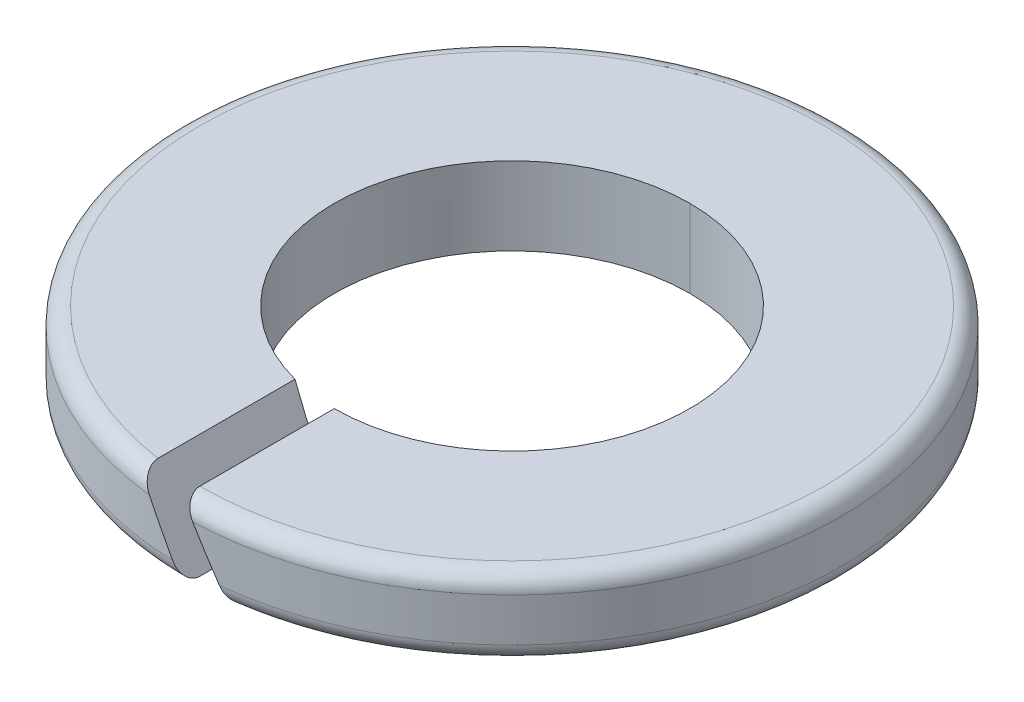
ISO-10303-21;
HEADER;
FILE_DESCRIPTION(('STEP AP214'),'2;1');
FILE_NAME('part.step','',(''),(''),'','','');
FILE_SCHEMA(('AUTOMOTIVE_DESIGN { 1 0 10303 214 1 1 1 1 }'));
ENDSEC;
DATA;
#1=APPLICATION_CONTEXT('core data for automotive mechanical design processes');
#2=APPLICATION_PROTOCOL_DEFINITION('international standard','automotive_design',2000,#1);
#3=PRODUCT_CONTEXT('',#1,'mechanical');
#4=PRODUCT('Part','Part','',(#3));
#5=PRODUCT_RELATED_PRODUCT_CATEGORY('part','',(#4));
#6=PRODUCT_DEFINITION_FORMATION('','',#4);
#7=PRODUCT_DEFINITION_CONTEXT('part definition',#1,'design');
#8=PRODUCT_DEFINITION('design','',#6,#7);
#9=PRODUCT_DEFINITION_SHAPE('','',#8);
#10=(LENGTH_UNIT() NAMED_UNIT(*) SI_UNIT(.MILLI.,.METRE.));
#11=(NAMED_UNIT(*) PLANE_ANGLE_UNIT() SI_UNIT($,.RADIAN.));
#12=(NAMED_UNIT(*) SI_UNIT($,.STERADIAN.) SOLID_ANGLE_UNIT());
#13=UNCERTAINTY_MEASURE_WITH_UNIT(LENGTH_MEASURE(1.E-05),#10,'distance_accuracy_value','');
#14=(GEOMETRIC_REPRESENTATION_CONTEXT(3) GLOBAL_UNCERTAINTY_ASSIGNED_CONTEXT((#13)) GLOBAL_UNIT_ASSIGNED_CONTEXT((#10,
#11,#12)) REPRESENTATION_CONTEXT('',''));
#15=CARTESIAN_POINT('',(0.,0.,0.));
#16=DIRECTION('',(0.,0.,1.));
#17=DIRECTION('',(1.,0.,0.));
#18=AXIS2_PLACEMENT_3D('',#15,#16,#17);
#19=CARTESIAN_POINT('',(0.,0.7,0.));
#20=DIRECTION('',(0.,1.,0.));
#21=DIRECTION('',(0.,0.,1.));
#22=AXIS2_PLACEMENT_3D('',#19,#20,#21);
#23=TOROIDAL_SURFACE('',#22,3.6,0.2);
#24=CARTESIAN_POINT('',(0.1154700538377,0.700000000000001,3.7982452088651));
#25=CARTESIAN_POINT('',(0.070434984372156,0.778003028437152,3.79961431528394));
#26=CARTESIAN_POINT('',(0.0368201317098262,0.836225661137575,3.74625187536077));
#27=CARTESIAN_POINT('',(0.0201322248122981,0.865129963756234,3.71976038845145));
#28=CARTESIAN_POINT('',(0.0100896622668535,0.882524192323229,3.68123701655366));
#29=CARTESIAN_POINT('',(0.,0.900000000000728,3.64253296964628));
#30=CARTESIAN_POINT('',(0.,0.900000000000728,3.6));
#31=B_SPLINE_CURVE_WITH_KNOTS('',2,(#24,#25,#26,#27,#28,#29,#30),.UNSPECIFIED.,.F.,.F.,(3,2,2,
3),(0.,0.5,0.75,1.),.UNSPECIFIED.);
#32=CARTESIAN_POINT('',(0.1154700538377,0.7,3.7982452088651));
#33=VERTEX_POINT('',#32);
#34=CARTESIAN_POINT('',(0.,0.900000000000728,3.6));
#35=VERTEX_POINT('',#34);
#36=EDGE_CURVE('E41',#33,#35,#31,.T.);
#37=ORIENTED_EDGE('',*,*,#36,.F.);
#38=CARTESIAN_POINT('',(0.,0.7,0.));
#39=DIRECTION('',(0.,-1.,0.));
#40=DIRECTION('',(0.,0.,1.));
#41=AXIS2_PLACEMENT_3D('',#38,#39,#40);
#42=CIRCLE('',#41,3.8);
#43=CARTESIAN_POINT('',(0.,0.7,-3.8));
#44=VERTEX_POINT('',#43);
#45=EDGE_CURVE('E267',#44,#33,#42,.T.);
#46=ORIENTED_EDGE('',*,*,#45,.F.);
#47=CARTESIAN_POINT('',(0.,0.7,0.));
#48=DIRECTION('',(0.,-1.,0.));
#49=DIRECTION('',(0.,0.,1.));
#50=AXIS2_PLACEMENT_3D('',#47,#48,#49);
#51=CIRCLE('',#50,3.8);
#52=CARTESIAN_POINT('',(-0.404145188430653,0.7,3.77844765302741));
#53=VERTEX_POINT('',#52);
#54=EDGE_CURVE('E160',#53,#44,#51,.T.);
#55=ORIENTED_EDGE('',*,*,#54,.F.);
#56=CARTESIAN_POINT('',(-0.5196152422684,0.900000000000726,3.56230262611171));
#57=CARTESIAN_POINT('',(-0.5196152422684,0.900000000000726,3.60455997760438));
#58=CARTESIAN_POINT('',(-0.509528894161323,0.882529932616352,3.6459490795633));
#59=CARTESIAN_POINT('',(-0.500256665980468,0.866469962307656,3.68399745876751));
#60=CARTESIAN_POINT('',(-0.483227314499348,0.836974260322256,3.71443207623571));
#61=CARTESIAN_POINT('',(-0.46751982207504,0.80976808538371,3.74250428578804));
#62=CARTESIAN_POINT('',(-0.446499307759668,0.77335948658807,3.7596365920271));
#63=CARTESIAN_POINT('',(-0.42633055054229,0.738426174361869,3.77607469244297));
#64=CARTESIAN_POINT('',(-0.404145188430653,0.700000000000002,3.77844765302741));
#65=B_SPLINE_CURVE_WITH_KNOTS('',2,(#56,#57,#58,#59,#60,#61,#62,#63,#64),.UNSPECIFIED.,.F.,.F.,
(3,2,2,2,3),(0.,0.25,0.5,0.75,1.),.UNSPECIFIED.);
#66=CARTESIAN_POINT('',(-0.519615242268401,0.900000000000728,3.56230262611171));
#67=VERTEX_POINT('',#66);
#68=EDGE_CURVE('E11',#67,#53,#65,.T.);
#69=ORIENTED_EDGE('',*,*,#68,.F.);
#70=CARTESIAN_POINT('',(0.,0.9,0.));
#71=DIRECTION('',(0.,1.,0.));
#72=DIRECTION('',(0.,0.,1.));
#73=AXIS2_PLACEMENT_3D('',#70,#71,#72);
#74=CIRCLE('',#73,3.6);
#75=EDGE_CURVE('E133',#35,#67,#74,.T.);
#76=ORIENTED_EDGE('',*,*,#75,.F.);
#77=EDGE_LOOP('',(#37,#46,#55,#69,#76));
#78=FACE_BOUND('',#77,.T.);
#79=ADVANCED_FACE('F17',(#78),#23,.T.);
#80=CARTESIAN_POINT('',(0.,0.2,0.));
#81=DIRECTION('',(0.,1.,0.));
#82=DIRECTION('',(0.,0.,1.));
#83=AXIS2_PLACEMENT_3D('',#80,#81,#82);
#84=TOROIDAL_SURFACE('',#83,3.6,0.2);
#85=CARTESIAN_POINT('',(0.,0.2,-3.6));
#86=DIRECTION('',(1.,0.,0.));
#87=DIRECTION('',(0.,0.,-1.));
#88=AXIS2_PLACEMENT_3D('',#85,#86,#87);
#89=CIRCLE('',#88,0.2);
#90=CARTESIAN_POINT('',(0.,0.,-3.6));
#91=VERTEX_POINT('',#90);
#92=CARTESIAN_POINT('',(0.,0.2,-3.8));
#93=VERTEX_POINT('',#92);
#94=EDGE_CURVE('E337',#91,#93,#89,.T.);
#95=ORIENTED_EDGE('',*,*,#94,.F.);
#96=CARTESIAN_POINT('',(0.,0.,0.));
#97=DIRECTION('',(0.,-1.,0.));
#98=DIRECTION('',(0.,0.,1.));
#99=AXIS2_PLACEMENT_3D('',#96,#97,#98);
#100=CIRCLE('',#99,3.6);
#101=CARTESIAN_POINT('',(0.,0.,3.6));
#102=VERTEX_POINT('',#101);
#103=EDGE_CURVE('E351',#102,#91,#100,.T.);
#104=ORIENTED_EDGE('',*,*,#103,.F.);
#105=CARTESIAN_POINT('',(-0.115470053837331,0.200000000000003,3.79824520886512));
#106=CARTESIAN_POINT('',(-0.0704349843717761,0.121996971562866,3.79961431528395));
#107=CARTESIAN_POINT('',(-0.0368201317094321,0.0637743388624435,3.74625187536079));
#108=CARTESIAN_POINT('',(-0.0201322248118701,0.0348700362437378,3.71976038845144));
#109=CARTESIAN_POINT('',(-0.0100896622664975,0.0174758076768745,3.68123701655368));
#110=CARTESIAN_POINT('',(0.,0.,3.64253296964743));
#111=CARTESIAN_POINT('',(0.,0.,3.6));
#112=B_SPLINE_CURVE_WITH_KNOTS('',2,(#105,#106,#107,#108,#109,#110,#111),.UNSPECIFIED.,.F.,.F.,
(3,2,2,3),(0.,0.5,0.75,1.),.UNSPECIFIED.);
#113=CARTESIAN_POINT('',(-0.115470053837331,0.200000000000003,3.79824520886512));
#114=VERTEX_POINT('',#113);
#115=EDGE_CURVE('E28',#114,#102,#112,.T.);
#116=ORIENTED_EDGE('',*,*,#115,.F.);
#117=CARTESIAN_POINT('',(0.,0.2,0.));
#118=DIRECTION('',(0.,1.,0.));
#119=DIRECTION('',(0.,0.,1.));
#120=AXIS2_PLACEMENT_3D('',#117,#118,#119);
#121=CIRCLE('',#120,3.8);
#122=EDGE_CURVE('E155',#93,#114,#121,.T.);
#123=ORIENTED_EDGE('',*,*,#122,.F.);
#124=EDGE_LOOP('',(#95,#104,#116,#123));
#125=FACE_BOUND('',#124,.T.);
#126=ADVANCED_FACE('F187',(#125),#84,.T.);
#127=CARTESIAN_POINT('',(0.,0.,3.8));
#128=DIRECTION('',(0.866025403785556,0.499999999998064,0.));
#129=DIRECTION('',(0.,0.,-1.));
#130=AXIS2_PLACEMENT_3D('',#127,#128,#129);
#131=PLANE('',#130);
#132=CARTESIAN_POINT('',(-0.404145188430653,0.7,3.77844765302741));
#133=CARTESIAN_POINT('',(-0.30819478110491,0.533809019504028,3.78871057023829));
#134=CARTESIAN_POINT('',(-0.211923202955767,0.367061754824015,3.79531294680486));
#135=CARTESIAN_POINT('',(-0.115470053837331,0.200000000000003,3.79824520886512));
#136=(BOUNDED_CURVE() B_SPLINE_CURVE(3,(#132,#133,#134,#135),.UNSPECIFIED.,.F.,
.F.) B_SPLINE_CURVE_WITH_KNOTS((4,4),(4.60583345789346,4.68199744582772),
.UNSPECIFIED.) CURVE() GEOMETRIC_REPRESENTATION_ITEM() RATIONAL_B_SPLINE_CURVE((1.,
0.999516645664311,0.999516645664311,1.)) REPRESENTATION_ITEM(''));
#137=EDGE_CURVE('E152',#53,#114,#136,.T.);
#138=ORIENTED_EDGE('',*,*,#137,.T.);
#139=ORIENTED_EDGE('',*,*,#115,.T.);
#140=DIRECTION('',(0.,0.,-1.));
#141=VECTOR('',#140,1.);
#142=CARTESIAN_POINT('',(0.,0.,3.8));
#143=LINE('',#142,#141);
#144=CARTESIAN_POINT('',(0.,0.,2.05));
#145=VERTEX_POINT('',#144);
#146=EDGE_CURVE('E117',#102,#145,#143,.T.);
#147=ORIENTED_EDGE('',*,*,#146,.T.);
#148=CARTESIAN_POINT('',(-0.519615242268401,0.900000000000728,1.98305320150578));
#149=CARTESIAN_POINT('',(-0.349753288920267,0.605790466527347,2.02756177040053));
#150=CARTESIAN_POINT('',(-0.175596400590394,0.304141887450351,2.05));
#151=CARTESIAN_POINT('',(0.,0.,2.05));
#152=(BOUNDED_CURVE() B_SPLINE_CURVE(3,(#148,#149,#150,#151),.UNSPECIFIED.,.F.,
.F.) B_SPLINE_CURVE_WITH_KNOTS((4,4),(4.45612237874558,4.71238898038469),
.UNSPECIFIED.) CURVE() GEOMETRIC_REPRESENTATION_ITEM() RATIONAL_B_SPLINE_CURVE((1.,
0.994534769294128,0.994534769294128,1.)) REPRESENTATION_ITEM(''));
#153=CARTESIAN_POINT('',(-0.519615242268401,0.900000000000728,1.98305320150578));
#154=VERTEX_POINT('',#153);
#155=EDGE_CURVE('E56',#154,#145,#152,.T.);
#156=ORIENTED_EDGE('',*,*,#155,.F.);
#157=DIRECTION('',(0.,0.,-1.));
#158=VECTOR('',#157,1.);
#159=CARTESIAN_POINT('',(-0.519615242268401,0.900000000000728,3.8));
#160=LINE('',#159,#158);
#161=EDGE_CURVE('E114',#67,#154,#160,.T.);
#162=ORIENTED_EDGE('',*,*,#161,.F.);
#163=ORIENTED_EDGE('',*,*,#68,.T.);
#164=EDGE_LOOP('',(#138,#139,#147,#156,#162,#163));
#165=FACE_BOUND('',#164,.T.);
#166=ADVANCED_FACE('F19',(#165),#131,.T.);
#167=CARTESIAN_POINT('',(0.,0.900000000000728,3.8));
#168=DIRECTION('',(-0.866025403785649,-0.499999999997904,0.));
#169=DIRECTION('',(-0.499999999997904,0.866025403785649,0.));
#170=AXIS2_PLACEMENT_3D('',#167,#168,#169);
#171=PLANE('',#170);
#172=DIRECTION('',(0.,0.,-1.));
#173=VECTOR('',#172,1.);
#174=CARTESIAN_POINT('',(0.519615242268179,0.,3.8));
#175=LINE('',#174,#173);
#176=CARTESIAN_POINT('',(0.519615242268179,0.,3.56230262611173));
#177=VERTEX_POINT('',#176);
#178=CARTESIAN_POINT('',(0.519615242268179,0.,1.98305320150584));
#179=VERTEX_POINT('',#178);
#180=EDGE_CURVE('E230',#177,#179,#175,.T.);
#181=ORIENTED_EDGE('',*,*,#180,.F.);
#182=CARTESIAN_POINT('',(0.519615242268179,0.,3.56230262611174));
#183=CARTESIAN_POINT('',(0.519615242268179,0.,3.6045599776053));
#184=CARTESIAN_POINT('',(0.509528894161439,0.0174700673837976,3.64594907956327));
#185=CARTESIAN_POINT('',(0.500256665980713,0.033530037692277,3.68399745876736));
#186=CARTESIAN_POINT('',(0.483227314499572,0.0630257396777256,3.71443207623566));
#187=CARTESIAN_POINT('',(0.467519822075332,0.0902319146161658,3.74250428578795));
#188=CARTESIAN_POINT('',(0.446499307759905,0.126640513411917,3.75963659202707));
#189=CARTESIAN_POINT('',(0.426330550542542,0.161573825638106,3.77607469244294));
#190=CARTESIAN_POINT('',(0.404145188430899,0.2,3.77844765302738));
#191=B_SPLINE_CURVE_WITH_KNOTS('',2,(#182,#183,#184,#185,#186,#187,#188,#189,#190),
.UNSPECIFIED.,.F.,.F.,(3,2,2,2,3),(0.,0.25,0.5,0.75,1.),.UNSPECIFIED.);
#192=CARTESIAN_POINT('',(0.404145188430899,0.2,3.77844765302738));
#193=VERTEX_POINT('',#192);
#194=EDGE_CURVE('E224',#177,#193,#191,.T.);
#195=ORIENTED_EDGE('',*,*,#194,.T.);
#196=CARTESIAN_POINT('',(0.404145188430899,0.2,3.77844765302738));
#197=CARTESIAN_POINT('',(0.308194781105197,0.366190980495974,3.78871057023827));
#198=CARTESIAN_POINT('',(0.211923202956095,0.532938245175988,3.79531294680484));
#199=CARTESIAN_POINT('',(0.1154700538377,0.7,3.7982452088651));
#200=(BOUNDED_CURVE() B_SPLINE_CURVE(3,(#196,#197,#198,#199),.UNSPECIFIED.,.F.,
.F.) B_SPLINE_CURVE_WITH_KNOTS((4,4),(1.4642408043036,1.54040479223783),
.UNSPECIFIED.) CURVE() GEOMETRIC_REPRESENTATION_ITEM() RATIONAL_B_SPLINE_CURVE((1.,
0.999516645664311,0.999516645664311,1.)) REPRESENTATION_ITEM(''));
#201=EDGE_CURVE('E119',#193,#33,#200,.T.);
#202=ORIENTED_EDGE('',*,*,#201,.T.);
#203=ORIENTED_EDGE('',*,*,#36,.T.);
#204=DIRECTION('',(0.,0.,-1.));
#205=VECTOR('',#204,1.);
#206=CARTESIAN_POINT('',(0.,0.900000000000728,3.8));
#207=LINE('',#206,#205);
#208=CARTESIAN_POINT('',(0.,0.9,2.05));
#209=VERTEX_POINT('',#208);
#210=EDGE_CURVE('E140',#35,#209,#207,.T.);
#211=ORIENTED_EDGE('',*,*,#210,.T.);
#212=CARTESIAN_POINT('',(0.519615242268179,0.,1.98305320150584));
#213=CARTESIAN_POINT('',(0.349753288920218,0.294209533473208,2.02756177040053));
#214=CARTESIAN_POINT('',(0.175596400590526,0.595858112550019,2.04999999999997));
#215=CARTESIAN_POINT('',(0.,0.9,2.05));
#216=(BOUNDED_CURVE() B_SPLINE_CURVE(3,(#212,#213,#214,#215),.UNSPECIFIED.,.F.,
.F.) B_SPLINE_CURVE_WITH_KNOTS((4,4),(1.3145297251559,1.57079632679474),
.UNSPECIFIED.) CURVE() GEOMETRIC_REPRESENTATION_ITEM() RATIONAL_B_SPLINE_CURVE((1.,
0.994534769294139,0.994534769294139,1.)) REPRESENTATION_ITEM(''));
#217=EDGE_CURVE('E167',#179,#209,#216,.T.);
#218=ORIENTED_EDGE('',*,*,#217,.F.);
#219=EDGE_LOOP('',(#181,#195,#202,#203,#211,#218));
#220=FACE_BOUND('',#219,.T.);
#221=ADVANCED_FACE('F198',(#220),#171,.T.);
#222=CARTESIAN_POINT('',(0.,0.9,0.));
#223=DIRECTION('',(0.,-1.,0.));
#224=DIRECTION('',(0.,0.,-1.));
#225=AXIS2_PLACEMENT_3D('',#222,#223,#224);
#226=CYLINDRICAL_SURFACE('',#225,2.05);
#227=DIRECTION('',(0.,-1.,0.));
#228=VECTOR('',#227,1.);
#229=CARTESIAN_POINT('',(0.,0.9,-2.05));
#230=LINE('',#229,#228);
#231=CARTESIAN_POINT('',(0.,0.9,-2.05));
#232=VERTEX_POINT('',#231);
#233=CARTESIAN_POINT('',(0.,0.,-2.05));
#234=VERTEX_POINT('',#233);
#235=EDGE_CURVE('E125',#232,#234,#230,.T.);
#236=ORIENTED_EDGE('',*,*,#235,.F.);
#237=CARTESIAN_POINT('',(0.,0.9,0.));
#238=DIRECTION('',(0.,1.,0.));
#239=DIRECTION('',(0.,0.,1.));
#240=AXIS2_PLACEMENT_3D('',#237,#238,#239);
#241=CIRCLE('',#240,2.05);
#242=EDGE_CURVE('E122',#232,#154,#241,.T.);
#243=ORIENTED_EDGE('',*,*,#242,.T.);
#244=ORIENTED_EDGE('',*,*,#155,.T.);
#245=CARTESIAN_POINT('',(0.,0.,0.));
#246=DIRECTION('',(0.,1.,0.));
#247=DIRECTION('',(0.,0.,1.));
#248=AXIS2_PLACEMENT_3D('',#245,#246,#247);
#249=CIRCLE('',#248,2.05);
#250=EDGE_CURVE('E278',#234,#145,#249,.T.);
#251=ORIENTED_EDGE('',*,*,#250,.F.);
#252=EDGE_LOOP('',(#236,#243,#244,#251));
#253=FACE_BOUND('',#252,.T.);
#254=ADVANCED_FACE('F123',(#253),#226,.F.);
#255=CARTESIAN_POINT('',(0.,0.9,0.));
#256=DIRECTION('',(0.,-1.,0.));
#257=DIRECTION('',(0.,0.,-1.));
#258=AXIS2_PLACEMENT_3D('',#255,#256,#257);
#259=CYLINDRICAL_SURFACE('',#258,3.8);
#260=DIRECTION('',(0.,-1.,0.));
#261=VECTOR('',#260,1.);
#262=CARTESIAN_POINT('',(0.,0.9,-3.8));
#263=LINE('',#262,#261);
#264=EDGE_CURVE('E166',#44,#93,#263,.T.);
#265=ORIENTED_EDGE('',*,*,#264,.F.);
#266=ORIENTED_EDGE('',*,*,#45,.T.);
#267=ORIENTED_EDGE('',*,*,#201,.F.);
#268=CARTESIAN_POINT('',(0.,0.2,0.));
#269=DIRECTION('',(0.,1.,0.));
#270=DIRECTION('',(0.,0.,1.));
#271=AXIS2_PLACEMENT_3D('',#268,#269,#270);
#272=CIRCLE('',#271,3.8);
#273=EDGE_CURVE('E302',#193,#93,#272,.T.);
#274=ORIENTED_EDGE('',*,*,#273,.T.);
#275=EDGE_LOOP('',(#265,#266,#267,#274));
#276=FACE_BOUND('',#275,.T.);
#277=ADVANCED_FACE('F196',(#276),#259,.T.);
#278=CARTESIAN_POINT('',(0.,0.,0.));
#279=DIRECTION('',(0.,1.,0.));
#280=DIRECTION('',(1.,0.,0.));
#281=AXIS2_PLACEMENT_3D('',#278,#279,#280);
#282=PLANE('',#281);
#283=ORIENTED_EDGE('',*,*,#146,.F.);
#284=ORIENTED_EDGE('',*,*,#103,.T.);
#285=CARTESIAN_POINT('',(0.,0.,0.));
#286=DIRECTION('',(0.,-1.,0.));
#287=DIRECTION('',(0.,0.,1.));
#288=AXIS2_PLACEMENT_3D('',#285,#286,#287);
#289=CIRCLE('',#288,3.6);
#290=EDGE_CURVE('E340',#91,#177,#289,.T.);
#291=ORIENTED_EDGE('',*,*,#290,.T.);
#292=ORIENTED_EDGE('',*,*,#180,.T.);
#293=CARTESIAN_POINT('',(0.,0.,0.));
#294=DIRECTION('',(0.,1.,0.));
#295=DIRECTION('',(0.,0.,1.));
#296=AXIS2_PLACEMENT_3D('',#293,#294,#295);
#297=CIRCLE('',#296,2.05);
#298=EDGE_CURVE('E292',#179,#234,#297,.T.);
#299=ORIENTED_EDGE('',*,*,#298,.T.);
#300=ORIENTED_EDGE('',*,*,#250,.T.);
#301=EDGE_LOOP('',(#283,#284,#291,#292,#299,#300));
#302=FACE_BOUND('',#301,.T.);
#303=ADVANCED_FACE('F247',(#302),#282,.F.);
#304=CARTESIAN_POINT('',(0.,0.9,0.));
#305=DIRECTION('',(0.,1.,0.));
#306=DIRECTION('',(1.,0.,0.));
#307=AXIS2_PLACEMENT_3D('',#304,#305,#306);
#308=PLANE('',#307);
#309=ORIENTED_EDGE('',*,*,#210,.F.);
#310=ORIENTED_EDGE('',*,*,#75,.T.);
#311=ORIENTED_EDGE('',*,*,#161,.T.);
#312=ORIENTED_EDGE('',*,*,#242,.F.);
#313=CARTESIAN_POINT('',(0.,0.9,0.));
#314=DIRECTION('',(0.,1.,0.));
#315=DIRECTION('',(0.,0.,1.));
#316=AXIS2_PLACEMENT_3D('',#313,#314,#315);
#317=CIRCLE('',#316,2.05);
#318=EDGE_CURVE('E290',#209,#232,#317,.T.);
#319=ORIENTED_EDGE('',*,*,#318,.F.);
#320=EDGE_LOOP('',(#309,#310,#311,#312,#319));
#321=FACE_BOUND('',#320,.T.);
#322=ADVANCED_FACE('F132',(#321),#308,.T.);
#323=CARTESIAN_POINT('',(0.,0.9,0.));
#324=DIRECTION('',(0.,-1.,0.));
#325=DIRECTION('',(0.,0.,-1.));
#326=AXIS2_PLACEMENT_3D('',#323,#324,#325);
#327=CYLINDRICAL_SURFACE('',#326,3.8);
#328=ORIENTED_EDGE('',*,*,#54,.T.);
#329=ORIENTED_EDGE('',*,*,#264,.T.);
#330=ORIENTED_EDGE('',*,*,#122,.T.);
#331=ORIENTED_EDGE('',*,*,#137,.F.);
#332=EDGE_LOOP('',(#328,#329,#330,#331));
#333=FACE_BOUND('',#332,.T.);
#334=ADVANCED_FACE('F245',(#333),#327,.T.);
#335=CARTESIAN_POINT('',(0.,0.9,0.));
#336=DIRECTION('',(0.,-1.,0.));
#337=DIRECTION('',(0.,0.,-1.));
#338=AXIS2_PLACEMENT_3D('',#335,#336,#337);
#339=CYLINDRICAL_SURFACE('',#338,2.05);
#340=ORIENTED_EDGE('',*,*,#318,.T.);
#341=ORIENTED_EDGE('',*,*,#235,.T.);
#342=ORIENTED_EDGE('',*,*,#298,.F.);
#343=ORIENTED_EDGE('',*,*,#217,.T.);
#344=EDGE_LOOP('',(#340,#341,#342,#343));
#345=FACE_BOUND('',#344,.T.);
#346=ADVANCED_FACE('F242',(#345),#339,.F.);
#347=CARTESIAN_POINT('',(0.,0.2,0.));
#348=DIRECTION('',(0.,1.,0.));
#349=DIRECTION('',(0.,0.,1.));
#350=AXIS2_PLACEMENT_3D('',#347,#348,#349);
#351=TOROIDAL_SURFACE('',#350,3.6,0.2);
#352=ORIENTED_EDGE('',*,*,#290,.F.);
#353=ORIENTED_EDGE('',*,*,#94,.T.);
#354=ORIENTED_EDGE('',*,*,#273,.F.);
#355=ORIENTED_EDGE('',*,*,#194,.F.);
#356=EDGE_LOOP('',(#352,#353,#354,#355));
#357=FACE_BOUND('',#356,.T.);
#358=ADVANCED_FACE('F232',(#357),#351,.T.);
#359=CLOSED_SHELL('',(#79,#126,#166,#221,#254,#277,#303,#322,#334,#346,#358));
#360=MANIFOLD_SOLID_BREP('B1',#359);
#361=ADVANCED_BREP_SHAPE_REPRESENTATION('',(#18,#360),#14);
#362=SHAPE_DEFINITION_REPRESENTATION(#9,#361);
ENDSEC;
END-ISO-10303-21;
